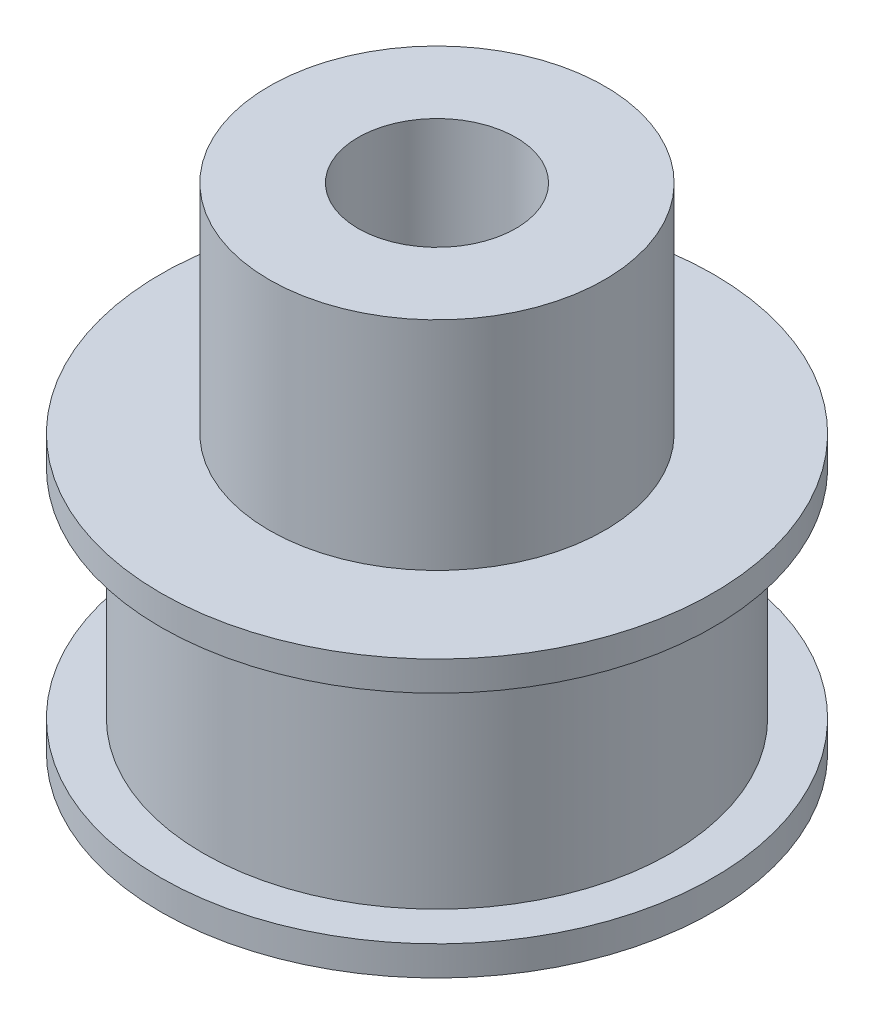
ISO-10303-21;
HEADER;
FILE_DESCRIPTION(('STEP AP214'),'2;1');
FILE_NAME('part.step','',(''),(''),'','','');
FILE_SCHEMA(('AUTOMOTIVE_DESIGN { 1 0 10303 214 1 1 1 1 }'));
ENDSEC;
DATA;
#1=APPLICATION_CONTEXT('core data for automotive mechanical design processes');
#2=APPLICATION_PROTOCOL_DEFINITION('international standard','automotive_design',2000,#1);
#3=PRODUCT_CONTEXT('',#1,'mechanical');
#4=PRODUCT('Part','Part','',(#3));
#5=PRODUCT_RELATED_PRODUCT_CATEGORY('part','',(#4));
#6=PRODUCT_DEFINITION_FORMATION('','',#4);
#7=PRODUCT_DEFINITION_CONTEXT('part definition',#1,'design');
#8=PRODUCT_DEFINITION('design','',#6,#7);
#9=PRODUCT_DEFINITION_SHAPE('','',#8);
#10=(LENGTH_UNIT() NAMED_UNIT(*) SI_UNIT(.MILLI.,.METRE.));
#11=(NAMED_UNIT(*) PLANE_ANGLE_UNIT() SI_UNIT($,.RADIAN.));
#12=(NAMED_UNIT(*) SI_UNIT($,.STERADIAN.) SOLID_ANGLE_UNIT());
#13=UNCERTAINTY_MEASURE_WITH_UNIT(LENGTH_MEASURE(1.E-05),#10,'distance_accuracy_value','');
#14=(GEOMETRIC_REPRESENTATION_CONTEXT(3) GLOBAL_UNCERTAINTY_ASSIGNED_CONTEXT((#13)) GLOBAL_UNIT_ASSIGNED_CONTEXT((#10,
#11,#12)) REPRESENTATION_CONTEXT('',''));
#15=CARTESIAN_POINT('',(0.,0.,0.));
#16=DIRECTION('',(0.,0.,1.));
#17=DIRECTION('',(1.,0.,0.));
#18=AXIS2_PLACEMENT_3D('',#15,#16,#17);
#19=CARTESIAN_POINT('',(0.,1.5,0.));
#20=DIRECTION('',(0.,-1.,0.));
#21=DIRECTION('',(0.,0.,-1.));
#22=AXIS2_PLACEMENT_3D('',#19,#20,#21);
#23=CYLINDRICAL_SURFACE('',#22,14.);
#24=CARTESIAN_POINT('',(0.,1.5,0.));
#25=DIRECTION('',(0.,1.,0.));
#26=DIRECTION('',(0.,0.,1.));
#27=AXIS2_PLACEMENT_3D('',#24,#25,#26);
#28=CIRCLE('',#27,14.);
#29=CARTESIAN_POINT('',(0.,1.5,14.));
#30=VERTEX_POINT('',#29);
#31=EDGE_CURVE('E10',#30,#30,#28,.T.);
#32=ORIENTED_EDGE('',*,*,#31,.F.);
#33=EDGE_LOOP('',(#32));
#34=FACE_BOUND('',#33,.T.);
#35=CARTESIAN_POINT('',(0.,0.,0.));
#36=DIRECTION('',(0.,1.,0.));
#37=DIRECTION('',(0.,0.,1.));
#38=AXIS2_PLACEMENT_3D('',#35,#36,#37);
#39=CIRCLE('',#38,14.);
#40=CARTESIAN_POINT('',(0.,0.,14.));
#41=VERTEX_POINT('',#40);
#42=EDGE_CURVE('E33',#41,#41,#39,.T.);
#43=ORIENTED_EDGE('',*,*,#42,.T.);
#44=EDGE_LOOP('',(#43));
#45=FACE_BOUND('',#44,.T.);
#46=ADVANCED_FACE('F30',(#34,#45),#23,.T.);
#47=CARTESIAN_POINT('',(0.,1.5,0.));
#48=DIRECTION('',(0.,1.,0.));
#49=DIRECTION('',(0.,0.,1.));
#50=AXIS2_PLACEMENT_3D('',#47,#48,#49);
#51=PLANE('',#50);
#52=CARTESIAN_POINT('',(0.,1.5,0.));
#53=DIRECTION('',(0.,1.,0.));
#54=DIRECTION('',(0.,0.,1.));
#55=AXIS2_PLACEMENT_3D('',#52,#53,#54);
#56=CIRCLE('',#55,11.85);
#57=CARTESIAN_POINT('',(0.,1.5,11.85));
#58=VERTEX_POINT('',#57);
#59=EDGE_CURVE('E42',#58,#58,#56,.T.);
#60=ORIENTED_EDGE('',*,*,#59,.F.);
#61=EDGE_LOOP('',(#60));
#62=FACE_BOUND('',#61,.T.);
#63=ORIENTED_EDGE('',*,*,#31,.T.);
#64=EDGE_LOOP('',(#63));
#65=FACE_BOUND('',#64,.T.);
#66=ADVANCED_FACE('F107',(#62,#65),#51,.T.);
#67=CARTESIAN_POINT('',(0.,0.,0.));
#68=DIRECTION('',(0.,1.,0.));
#69=DIRECTION('',(0.,0.,1.));
#70=AXIS2_PLACEMENT_3D('',#67,#68,#69);
#71=PLANE('',#70);
#72=CARTESIAN_POINT('',(0.,0.,0.));
#73=DIRECTION('',(0.,1.,0.));
#74=DIRECTION('',(0.,0.,1.));
#75=AXIS2_PLACEMENT_3D('',#72,#73,#74);
#76=CIRCLE('',#75,4.);
#77=CARTESIAN_POINT('',(0.,0.,4.));
#78=VERTEX_POINT('',#77);
#79=EDGE_CURVE('E57',#78,#78,#76,.T.);
#80=ORIENTED_EDGE('',*,*,#79,.T.);
#81=EDGE_LOOP('',(#80));
#82=FACE_BOUND('',#81,.T.);
#83=ORIENTED_EDGE('',*,*,#42,.F.);
#84=EDGE_LOOP('',(#83));
#85=FACE_BOUND('',#84,.T.);
#86=ADVANCED_FACE('F66',(#82,#85),#71,.F.);
#87=CARTESIAN_POINT('',(0.,12.5,0.));
#88=DIRECTION('',(0.,-1.,0.));
#89=DIRECTION('',(0.,0.,-1.));
#90=AXIS2_PLACEMENT_3D('',#87,#88,#89);
#91=CYLINDRICAL_SURFACE('',#90,11.85);
#92=CARTESIAN_POINT('',(0.,12.5,0.));
#93=DIRECTION('',(0.,1.,0.));
#94=DIRECTION('',(0.,0.,1.));
#95=AXIS2_PLACEMENT_3D('',#92,#93,#94);
#96=CIRCLE('',#95,11.85);
#97=CARTESIAN_POINT('',(0.,12.5,11.85));
#98=VERTEX_POINT('',#97);
#99=EDGE_CURVE('E40',#98,#98,#96,.T.);
#100=ORIENTED_EDGE('',*,*,#99,.F.);
#101=EDGE_LOOP('',(#100));
#102=FACE_BOUND('',#101,.T.);
#103=ORIENTED_EDGE('',*,*,#59,.T.);
#104=EDGE_LOOP('',(#103));
#105=FACE_BOUND('',#104,.T.);
#106=ADVANCED_FACE('F97',(#102,#105),#91,.T.);
#107=CARTESIAN_POINT('',(0.,14.,0.));
#108=DIRECTION('',(0.,-1.,0.));
#109=DIRECTION('',(0.,0.,-1.));
#110=AXIS2_PLACEMENT_3D('',#107,#108,#109);
#111=CYLINDRICAL_SURFACE('',#110,14.);
#112=CARTESIAN_POINT('',(0.,14.,0.));
#113=DIRECTION('',(0.,1.,0.));
#114=DIRECTION('',(0.,0.,1.));
#115=AXIS2_PLACEMENT_3D('',#112,#113,#114);
#116=CIRCLE('',#115,14.);
#117=CARTESIAN_POINT('',(0.,14.,14.));
#118=VERTEX_POINT('',#117);
#119=EDGE_CURVE('E45',#118,#118,#116,.T.);
#120=ORIENTED_EDGE('',*,*,#119,.F.);
#121=EDGE_LOOP('',(#120));
#122=FACE_BOUND('',#121,.T.);
#123=CARTESIAN_POINT('',(0.,12.5,0.));
#124=DIRECTION('',(0.,1.,0.));
#125=DIRECTION('',(0.,0.,1.));
#126=AXIS2_PLACEMENT_3D('',#123,#124,#125);
#127=CIRCLE('',#126,14.);
#128=CARTESIAN_POINT('',(0.,12.5,14.));
#129=VERTEX_POINT('',#128);
#130=EDGE_CURVE('E48',#129,#129,#127,.T.);
#131=ORIENTED_EDGE('',*,*,#130,.T.);
#132=EDGE_LOOP('',(#131));
#133=FACE_BOUND('',#132,.T.);
#134=ADVANCED_FACE('F91',(#122,#133),#111,.T.);
#135=CARTESIAN_POINT('',(0.,14.,0.));
#136=DIRECTION('',(0.,1.,0.));
#137=DIRECTION('',(0.,0.,1.));
#138=AXIS2_PLACEMENT_3D('',#135,#136,#137);
#139=PLANE('',#138);
#140=CARTESIAN_POINT('',(0.,14.,0.));
#141=DIRECTION('',(0.,1.,0.));
#142=DIRECTION('',(0.,0.,1.));
#143=AXIS2_PLACEMENT_3D('',#140,#141,#142);
#144=CIRCLE('',#143,8.5);
#145=CARTESIAN_POINT('',(0.,14.,8.5));
#146=VERTEX_POINT('',#145);
#147=EDGE_CURVE('E54',#146,#146,#144,.T.);
#148=ORIENTED_EDGE('',*,*,#147,.F.);
#149=EDGE_LOOP('',(#148));
#150=FACE_BOUND('',#149,.T.);
#151=ORIENTED_EDGE('',*,*,#119,.T.);
#152=EDGE_LOOP('',(#151));
#153=FACE_BOUND('',#152,.T.);
#154=ADVANCED_FACE('F88',(#150,#153),#139,.T.);
#155=CARTESIAN_POINT('',(0.,12.5,0.));
#156=DIRECTION('',(0.,1.,0.));
#157=DIRECTION('',(0.,0.,1.));
#158=AXIS2_PLACEMENT_3D('',#155,#156,#157);
#159=PLANE('',#158);
#160=ORIENTED_EDGE('',*,*,#99,.T.);
#161=EDGE_LOOP('',(#160));
#162=FACE_BOUND('',#161,.T.);
#163=ORIENTED_EDGE('',*,*,#130,.F.);
#164=EDGE_LOOP('',(#163));
#165=FACE_BOUND('',#164,.T.);
#166=ADVANCED_FACE('F84',(#162,#165),#159,.F.);
#167=CARTESIAN_POINT('',(0.,25.,0.));
#168=DIRECTION('',(0.,-1.,0.));
#169=DIRECTION('',(0.,0.,-1.));
#170=AXIS2_PLACEMENT_3D('',#167,#168,#169);
#171=CYLINDRICAL_SURFACE('',#170,8.5);
#172=CARTESIAN_POINT('',(0.,25.,0.));
#173=DIRECTION('',(0.,1.,0.));
#174=DIRECTION('',(0.,0.,1.));
#175=AXIS2_PLACEMENT_3D('',#172,#173,#174);
#176=CIRCLE('',#175,8.5);
#177=CARTESIAN_POINT('',(0.,25.,8.5));
#178=VERTEX_POINT('',#177);
#179=EDGE_CURVE('E51',#178,#178,#176,.T.);
#180=ORIENTED_EDGE('',*,*,#179,.F.);
#181=EDGE_LOOP('',(#180));
#182=FACE_BOUND('',#181,.T.);
#183=ORIENTED_EDGE('',*,*,#147,.T.);
#184=EDGE_LOOP('',(#183));
#185=FACE_BOUND('',#184,.T.);
#186=ADVANCED_FACE('F78',(#182,#185),#171,.T.);
#187=CARTESIAN_POINT('',(0.,25.,0.));
#188=DIRECTION('',(0.,1.,0.));
#189=DIRECTION('',(0.,0.,1.));
#190=AXIS2_PLACEMENT_3D('',#187,#188,#189);
#191=PLANE('',#190);
#192=CARTESIAN_POINT('',(0.,25.,0.));
#193=DIRECTION('',(0.,1.,0.));
#194=DIRECTION('',(0.,0.,1.));
#195=AXIS2_PLACEMENT_3D('',#192,#193,#194);
#196=CIRCLE('',#195,4.);
#197=CARTESIAN_POINT('',(0.,25.,4.));
#198=VERTEX_POINT('',#197);
#199=EDGE_CURVE('E60',#198,#198,#196,.T.);
#200=ORIENTED_EDGE('',*,*,#199,.F.);
#201=EDGE_LOOP('',(#200));
#202=FACE_BOUND('',#201,.T.);
#203=ORIENTED_EDGE('',*,*,#179,.T.);
#204=EDGE_LOOP('',(#203));
#205=FACE_BOUND('',#204,.T.);
#206=ADVANCED_FACE('F72',(#202,#205),#191,.T.);
#207=CARTESIAN_POINT('',(0.,0.,0.));
#208=DIRECTION('',(0.,1.,0.));
#209=DIRECTION('',(0.,0.,1.));
#210=AXIS2_PLACEMENT_3D('',#207,#208,#209);
#211=CYLINDRICAL_SURFACE('',#210,4.);
#212=ORIENTED_EDGE('',*,*,#79,.F.);
#213=EDGE_LOOP('',(#212));
#214=FACE_BOUND('',#213,.T.);
#215=ORIENTED_EDGE('',*,*,#199,.T.);
#216=EDGE_LOOP('',(#215));
#217=FACE_BOUND('',#216,.T.);
#218=ADVANCED_FACE('F69',(#214,#217),#211,.F.);
#219=CLOSED_SHELL('',(#46,#66,#86,#106,#134,#154,#166,#186,#206,#218));
#220=MANIFOLD_SOLID_BREP('B2',#219);
#221=ADVANCED_BREP_SHAPE_REPRESENTATION('',(#18,#220),#14);
#222=SHAPE_DEFINITION_REPRESENTATION(#9,#221);
ENDSEC;
END-ISO-10303-21;
